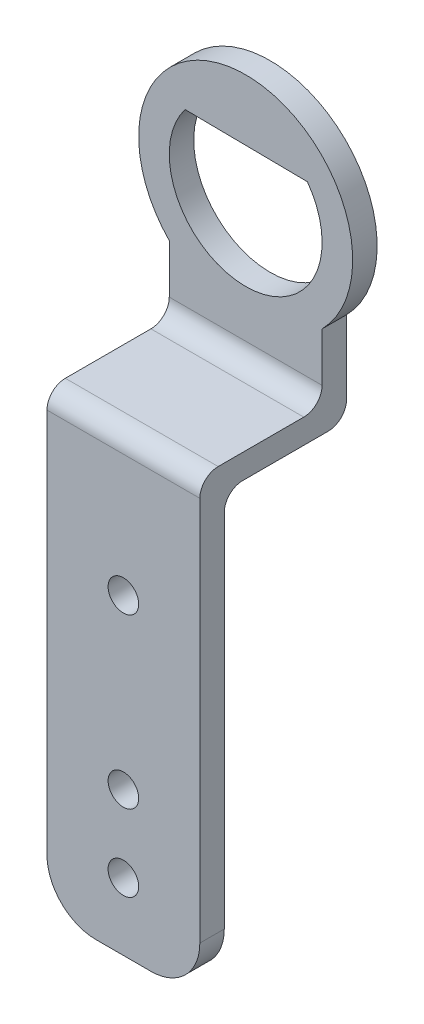
ISO-10303-21;
HEADER;
FILE_DESCRIPTION(('STEP AP214'),'2;1');
FILE_NAME('part.step','',(''),(''),'','','');
FILE_SCHEMA(('AUTOMOTIVE_DESIGN { 1 0 10303 214 1 1 1 1 }'));
ENDSEC;
DATA;
#1=APPLICATION_CONTEXT('core data for automotive mechanical design processes');
#2=APPLICATION_PROTOCOL_DEFINITION('international standard','automotive_design',2000,#1);
#3=PRODUCT_CONTEXT('',#1,'mechanical');
#4=PRODUCT('Part','Part','',(#3));
#5=PRODUCT_RELATED_PRODUCT_CATEGORY('part','',(#4));
#6=PRODUCT_DEFINITION_FORMATION('','',#4);
#7=PRODUCT_DEFINITION_CONTEXT('part definition',#1,'design');
#8=PRODUCT_DEFINITION('design','',#6,#7);
#9=PRODUCT_DEFINITION_SHAPE('','',#8);
#10=(LENGTH_UNIT() NAMED_UNIT(*) SI_UNIT(.MILLI.,.METRE.));
#11=(NAMED_UNIT(*) PLANE_ANGLE_UNIT() SI_UNIT($,.RADIAN.));
#12=(NAMED_UNIT(*) SI_UNIT($,.STERADIAN.) SOLID_ANGLE_UNIT());
#13=UNCERTAINTY_MEASURE_WITH_UNIT(LENGTH_MEASURE(1.E-05),#10,'distance_accuracy_value','');
#14=(GEOMETRIC_REPRESENTATION_CONTEXT(3) GLOBAL_UNCERTAINTY_ASSIGNED_CONTEXT((#13)) GLOBAL_UNIT_ASSIGNED_CONTEXT((#10,
#11,#12)) REPRESENTATION_CONTEXT('',''));
#15=CARTESIAN_POINT('',(0.,0.,0.));
#16=DIRECTION('',(0.,0.,1.));
#17=DIRECTION('',(1.,0.,0.));
#18=AXIS2_PLACEMENT_3D('',#15,#16,#17);
#19=CARTESIAN_POINT('',(0.266025337211541,-3.51925285208698,0.4));
#20=DIRECTION('',(0.,1.,0.));
#21=DIRECTION('',(0.,0.,1.));
#22=AXIS2_PLACEMENT_3D('',#19,#20,#21);
#23=PLANE('',#22);
#24=DIRECTION('',(0.,0.,-1.));
#25=VECTOR('',#24,1.);
#26=CARTESIAN_POINT('',(0.266025337211541,-3.51925285208698,0.4));
#27=LINE('',#26,#25);
#28=CARTESIAN_POINT('',(0.266025337211541,-3.51925285208698,1.7));
#29=VERTEX_POINT('',#28);
#30=CARTESIAN_POINT('',(0.266025337211541,-3.51925285208698,0.3));
#31=VERTEX_POINT('',#30);
#32=EDGE_CURVE('E221',#29,#31,#27,.T.);
#33=ORIENTED_EDGE('',*,*,#32,.T.);
#34=DIRECTION('',(1.,0.,0.));
#35=VECTOR('',#34,1.);
#36=CARTESIAN_POINT('',(0.266025337211541,-3.51925285208698,0.3));
#37=LINE('',#36,#35);
#38=CARTESIAN_POINT('',(2.76602533721154,-3.51925285208698,0.3));
#39=VERTEX_POINT('',#38);
#40=EDGE_CURVE('E242',#31,#39,#37,.T.);
#41=ORIENTED_EDGE('',*,*,#40,.T.);
#42=DIRECTION('',(0.,0.,-1.));
#43=VECTOR('',#42,1.);
#44=CARTESIAN_POINT('',(2.76602533721154,-3.51925285208698,0.4));
#45=LINE('',#44,#43);
#46=CARTESIAN_POINT('',(2.76602533721154,-3.51925285208698,1.7));
#47=VERTEX_POINT('',#46);
#48=EDGE_CURVE('E217',#47,#39,#45,.T.);
#49=ORIENTED_EDGE('',*,*,#48,.F.);
#50=DIRECTION('',(1.,0.,0.));
#51=VECTOR('',#50,1.);
#52=CARTESIAN_POINT('',(0.26602533721154,-3.51925285208698,1.7));
#53=LINE('',#52,#51);
#54=EDGE_CURVE('E239',#47,#29,#53,.F.);
#55=ORIENTED_EDGE('',*,*,#54,.T.);
#56=EDGE_LOOP('',(#33,#41,#49,#55));
#57=FACE_BOUND('',#56,.T.);
#58=ADVANCED_FACE('F41',(#57),#23,.F.);
#59=CARTESIAN_POINT('',(1.51602533721154,-0.794507980695394,0.4));
#60=DIRECTION('',(0.,0.,1.));
#61=DIRECTION('',(1.,0.,0.));
#62=AXIS2_PLACEMENT_3D('',#59,#60,#61);
#63=PLANE('',#62);
#64=DIRECTION('',(0.,-1.,0.));
#65=VECTOR('',#64,1.);
#66=CARTESIAN_POINT('',(0.26602533721154,-2.01925285208698,0.4));
#67=LINE('',#66,#65);
#68=CARTESIAN_POINT('',(0.26602533721154,-2.01925285208698,0.4));
#69=VERTEX_POINT('',#68);
#70=CARTESIAN_POINT('',(0.266025337211541,-2.81925285208698,0.4));
#71=VERTEX_POINT('',#70);
#72=EDGE_CURVE('E196',#69,#71,#67,.T.);
#73=ORIENTED_EDGE('',*,*,#72,.T.);
#74=DIRECTION('',(-1.,0.,0.));
#75=VECTOR('',#74,1.);
#76=CARTESIAN_POINT('',(1.51602533721154,-2.81925285208698,0.4));
#77=LINE('',#76,#75);
#78=CARTESIAN_POINT('',(2.76602533721154,-2.81925285208698,0.4));
#79=VERTEX_POINT('',#78);
#80=EDGE_CURVE('E236',#71,#79,#77,.F.);
#81=ORIENTED_EDGE('',*,*,#80,.T.);
#82=DIRECTION('',(0.,1.,0.));
#83=VECTOR('',#82,1.);
#84=CARTESIAN_POINT('',(2.76602533721154,-2.01925285208698,0.4));
#85=LINE('',#84,#83);
#86=CARTESIAN_POINT('',(2.76602533721154,-2.01925285208698,0.4));
#87=VERTEX_POINT('',#86);
#88=EDGE_CURVE('E201',#79,#87,#85,.T.);
#89=ORIENTED_EDGE('',*,*,#88,.T.);
#90=CARTESIAN_POINT('',(1.51602533721154,-0.794507980695394,0.4));
#91=DIRECTION('',(0.,0.,1.));
#92=DIRECTION('',(1.,0.,0.));
#93=AXIS2_PLACEMENT_3D('',#90,#91,#92);
#94=CIRCLE('',#93,1.75);
#95=EDGE_CURVE('E192',#87,#69,#94,.T.);
#96=ORIENTED_EDGE('',*,*,#95,.T.);
#97=EDGE_LOOP('',(#73,#81,#89,#96));
#98=FACE_BOUND('',#97,.T.);
#99=DIRECTION('',(-0.999932424571889,0.0116252436440397,0.));
#100=VECTOR('',#99,1.);
#101=CARTESIAN_POINT('',(2.52467669451646,-0.0561839059105169,0.4));
#102=LINE('',#101,#100);
#103=CARTESIAN_POINT('',(2.52467669451646,-0.0561839059105168,0.4));
#104=VERTEX_POINT('',#103);
#105=CARTESIAN_POINT('',(0.524811845372683,-0.0329334186224376,0.4));
#106=VERTEX_POINT('',#105);
#107=EDGE_CURVE('E158',#104,#106,#102,.T.);
#108=ORIENTED_EDGE('',*,*,#107,.F.);
#109=CARTESIAN_POINT('',(1.51602533721154,-0.794507980695394,0.4));
#110=DIRECTION('',(0.,0.,1.));
#111=DIRECTION('',(1.,0.,0.));
#112=AXIS2_PLACEMENT_3D('',#109,#110,#111);
#113=CIRCLE('',#112,1.25);
#114=EDGE_CURVE('E169',#106,#104,#113,.T.);
#115=ORIENTED_EDGE('',*,*,#114,.F.);
#116=EDGE_LOOP('',(#108,#115));
#117=FACE_BOUND('',#116,.T.);
#118=ADVANCED_FACE('F177',(#98,#117),#63,.T.);
#119=CARTESIAN_POINT('',(1.51602533721154,-0.794507980695394,0.));
#120=DIRECTION('',(0.,0.,1.));
#121=DIRECTION('',(1.,0.,0.));
#122=AXIS2_PLACEMENT_3D('',#119,#120,#121);
#123=PLANE('',#122);
#124=DIRECTION('',(0.,1.,0.));
#125=VECTOR('',#124,1.);
#126=CARTESIAN_POINT('',(2.76602533721154,-2.01925285208698,0.));
#127=LINE('',#126,#125);
#128=CARTESIAN_POINT('',(2.76602533721154,-3.21925285208698,0.));
#129=VERTEX_POINT('',#128);
#130=CARTESIAN_POINT('',(2.76602533721154,-2.01925285208698,0.));
#131=VERTEX_POINT('',#130);
#132=EDGE_CURVE('E197',#129,#131,#127,.T.);
#133=ORIENTED_EDGE('',*,*,#132,.F.);
#134=DIRECTION('',(1.,0.,0.));
#135=VECTOR('',#134,1.);
#136=CARTESIAN_POINT('',(1.51602533721154,-3.21925285208698,0.));
#137=LINE('',#136,#135);
#138=CARTESIAN_POINT('',(0.266025337211541,-3.21925285208698,0.));
#139=VERTEX_POINT('',#138);
#140=EDGE_CURVE('E253',#129,#139,#137,.F.);
#141=ORIENTED_EDGE('',*,*,#140,.T.);
#142=DIRECTION('',(0.,-1.,0.));
#143=VECTOR('',#142,1.);
#144=CARTESIAN_POINT('',(0.26602533721154,-2.01925285208698,0.));
#145=LINE('',#144,#143);
#146=CARTESIAN_POINT('',(0.26602533721154,-2.01925285208698,0.));
#147=VERTEX_POINT('',#146);
#148=EDGE_CURVE('E208',#147,#139,#145,.T.);
#149=ORIENTED_EDGE('',*,*,#148,.F.);
#150=CARTESIAN_POINT('',(1.51602533721154,-0.794507980695394,0.));
#151=DIRECTION('',(0.,0.,1.));
#152=DIRECTION('',(1.,0.,0.));
#153=AXIS2_PLACEMENT_3D('',#150,#151,#152);
#154=CIRCLE('',#153,1.75);
#155=EDGE_CURVE('E191',#131,#147,#154,.T.);
#156=ORIENTED_EDGE('',*,*,#155,.F.);
#157=EDGE_LOOP('',(#133,#141,#149,#156));
#158=FACE_BOUND('',#157,.T.);
#159=CARTESIAN_POINT('',(1.51602533721154,-0.794507980695394,0.));
#160=DIRECTION('',(0.,0.,1.));
#161=DIRECTION('',(1.,0.,0.));
#162=AXIS2_PLACEMENT_3D('',#159,#160,#161);
#163=CIRCLE('',#162,1.25);
#164=CARTESIAN_POINT('',(0.524811845372683,-0.0329334186224375,0.));
#165=VERTEX_POINT('',#164);
#166=CARTESIAN_POINT('',(2.52467669451646,-0.0561839059105169,0.));
#167=VERTEX_POINT('',#166);
#168=EDGE_CURVE('E174',#165,#167,#163,.T.);
#169=ORIENTED_EDGE('',*,*,#168,.T.);
#170=DIRECTION('',(-0.999932424571889,0.0116252436440397,0.));
#171=VECTOR('',#170,1.);
#172=CARTESIAN_POINT('',(2.52467669451646,-0.0561839059105169,0.));
#173=LINE('',#172,#171);
#174=EDGE_CURVE('E179',#167,#165,#173,.T.);
#175=ORIENTED_EDGE('',*,*,#174,.T.);
#176=EDGE_LOOP('',(#169,#175));
#177=FACE_BOUND('',#176,.T.);
#178=ADVANCED_FACE('F414',(#158,#177),#123,.F.);
#179=CARTESIAN_POINT('',(1.51602533721154,-0.794507980695394,0.4));
#180=DIRECTION('',(0.,0.,-1.));
#181=DIRECTION('',(-1.,0.,0.));
#182=AXIS2_PLACEMENT_3D('',#179,#180,#181);
#183=CYLINDRICAL_SURFACE('',#182,1.75);
#184=ORIENTED_EDGE('',*,*,#155,.T.);
#185=DIRECTION('',(0.,0.,-1.));
#186=VECTOR('',#185,1.);
#187=CARTESIAN_POINT('',(0.26602533721154,-2.01925285208698,0.4));
#188=LINE('',#187,#186);
#189=EDGE_CURVE('E225',#69,#147,#188,.T.);
#190=ORIENTED_EDGE('',*,*,#189,.F.);
#191=ORIENTED_EDGE('',*,*,#95,.F.);
#192=DIRECTION('',(0.,0.,-1.));
#193=VECTOR('',#192,1.);
#194=CARTESIAN_POINT('',(2.76602533721154,-2.01925285208698,0.4));
#195=LINE('',#194,#193);
#196=EDGE_CURVE('E204',#87,#131,#195,.T.);
#197=ORIENTED_EDGE('',*,*,#196,.T.);
#198=EDGE_LOOP('',(#184,#190,#191,#197));
#199=FACE_BOUND('',#198,.T.);
#200=ADVANCED_FACE('F365',(#199),#183,.T.);
#201=CARTESIAN_POINT('',(0.26602533721154,-2.01925285208698,0.4));
#202=DIRECTION('',(1.,0.,0.));
#203=DIRECTION('',(0.,1.,0.));
#204=AXIS2_PLACEMENT_3D('',#201,#202,#203);
#205=PLANE('',#204);
#206=DIRECTION('',(0.,1.,0.));
#207=VECTOR('',#206,1.);
#208=CARTESIAN_POINT('',(0.266025337211541,-10.519252852087,2.));
#209=LINE('',#208,#207);
#210=CARTESIAN_POINT('',(0.266025337211541,-9.71925285208698,2.));
#211=VERTEX_POINT('',#210);
#212=CARTESIAN_POINT('',(0.266025337211541,-3.81925285208698,2.));
#213=VERTEX_POINT('',#212);
#214=EDGE_CURVE('E333',#211,#213,#209,.T.);
#215=ORIENTED_EDGE('',*,*,#214,.F.);
#216=DIRECTION('',(0.,0.,-1.));
#217=VECTOR('',#216,1.);
#218=CARTESIAN_POINT('',(0.266025337211541,-9.71925285208698,0.4));
#219=LINE('',#218,#217);
#220=CARTESIAN_POINT('',(0.266025337211541,-9.71925285208698,2.4));
#221=VERTEX_POINT('',#220);
#222=EDGE_CURVE('E67',#211,#221,#219,.F.);
#223=ORIENTED_EDGE('',*,*,#222,.T.);
#224=DIRECTION('',(0.,-1.,0.));
#225=VECTOR('',#224,1.);
#226=CARTESIAN_POINT('',(0.266025337211541,-3.11925285208698,2.4));
#227=LINE('',#226,#225);
#228=CARTESIAN_POINT('',(0.266025337211541,-3.41925285208698,2.4));
#229=VERTEX_POINT('',#228);
#230=EDGE_CURVE('E339',#229,#221,#227,.T.);
#231=ORIENTED_EDGE('',*,*,#230,.F.);
#232=CARTESIAN_POINT('',(0.266025337211541,-3.41925285208698,2.1));
#233=DIRECTION('',(1.,0.,0.));
#234=DIRECTION('',(0.,1.,0.));
#235=AXIS2_PLACEMENT_3D('',#232,#233,#234);
#236=CIRCLE('',#235,0.3);
#237=CARTESIAN_POINT('',(0.266025337211541,-3.11925285208698,2.1));
#238=VERTEX_POINT('',#237);
#239=EDGE_CURVE('E256',#229,#238,#236,.F.);
#240=ORIENTED_EDGE('',*,*,#239,.T.);
#241=DIRECTION('',(0.,0.,-1.));
#242=VECTOR('',#241,1.);
#243=CARTESIAN_POINT('',(0.266025337211541,-3.11925285208698,2.4));
#244=LINE('',#243,#242);
#245=CARTESIAN_POINT('',(0.266025337211541,-3.11925285208698,0.7));
#246=VERTEX_POINT('',#245);
#247=EDGE_CURVE('E341',#238,#246,#244,.T.);
#248=ORIENTED_EDGE('',*,*,#247,.T.);
#249=CARTESIAN_POINT('',(0.266025337211541,-2.81925285208698,0.7));
#250=DIRECTION('',(1.,0.,0.));
#251=DIRECTION('',(0.,1.,0.));
#252=AXIS2_PLACEMENT_3D('',#249,#250,#251);
#253=CIRCLE('',#252,0.3);
#254=EDGE_CURVE('E270',#246,#71,#253,.T.);
#255=ORIENTED_EDGE('',*,*,#254,.T.);
#256=ORIENTED_EDGE('',*,*,#72,.F.);
#257=ORIENTED_EDGE('',*,*,#189,.T.);
#258=ORIENTED_EDGE('',*,*,#148,.T.);
#259=CARTESIAN_POINT('',(0.266025337211541,-3.21925285208698,0.3));
#260=DIRECTION('',(1.,0.,0.));
#261=DIRECTION('',(0.,1.,0.));
#262=AXIS2_PLACEMENT_3D('',#259,#260,#261);
#263=CIRCLE('',#262,0.3);
#264=EDGE_CURVE('E259',#139,#31,#263,.F.);
#265=ORIENTED_EDGE('',*,*,#264,.T.);
#266=ORIENTED_EDGE('',*,*,#32,.F.);
#267=CARTESIAN_POINT('',(0.26602533721154,-3.81925285208698,1.7));
#268=DIRECTION('',(1.,0.,0.));
#269=DIRECTION('',(0.,1.,0.));
#270=AXIS2_PLACEMENT_3D('',#267,#268,#269);
#271=CIRCLE('',#270,0.3);
#272=EDGE_CURVE('E279',#29,#213,#271,.T.);
#273=ORIENTED_EDGE('',*,*,#272,.T.);
#274=EDGE_LOOP('',(#215,#223,#231,#240,#248,#255,#256,#257,#258,#265,#266,#273));
#275=FACE_BOUND('',#274,.T.);
#276=ADVANCED_FACE('F358',(#275),#205,.F.);
#277=CARTESIAN_POINT('',(2.76602533721154,-2.01925285208698,0.4));
#278=DIRECTION('',(-1.,0.,0.));
#279=DIRECTION('',(0.,0.,1.));
#280=AXIS2_PLACEMENT_3D('',#277,#278,#279);
#281=PLANE('',#280);
#282=DIRECTION('',(0.,1.,0.));
#283=VECTOR('',#282,1.);
#284=CARTESIAN_POINT('',(2.76602533721154,-3.51925285208698,2.4));
#285=LINE('',#284,#283);
#286=CARTESIAN_POINT('',(2.76602533721154,-9.71925285208698,2.4));
#287=VERTEX_POINT('',#286);
#288=CARTESIAN_POINT('',(2.76602533721154,-3.41925285208698,2.4));
#289=VERTEX_POINT('',#288);
#290=EDGE_CURVE('E336',#287,#289,#285,.T.);
#291=ORIENTED_EDGE('',*,*,#290,.F.);
#292=DIRECTION('',(0.,0.,1.));
#293=VECTOR('',#292,1.);
#294=CARTESIAN_POINT('',(2.76602533721154,-9.71925285208698,0.4));
#295=LINE('',#294,#293);
#296=CARTESIAN_POINT('',(2.76602533721154,-9.71925285208698,2.));
#297=VERTEX_POINT('',#296);
#298=EDGE_CURVE('E11',#287,#297,#295,.F.);
#299=ORIENTED_EDGE('',*,*,#298,.T.);
#300=DIRECTION('',(0.,1.,0.));
#301=VECTOR('',#300,1.);
#302=CARTESIAN_POINT('',(2.76602533721154,-10.519252852087,2.));
#303=LINE('',#302,#301);
#304=CARTESIAN_POINT('',(2.76602533721154,-3.81925285208698,2.));
#305=VERTEX_POINT('',#304);
#306=EDGE_CURVE('E325',#297,#305,#303,.T.);
#307=ORIENTED_EDGE('',*,*,#306,.T.);
#308=CARTESIAN_POINT('',(2.76602533721154,-3.81925285208698,1.7));
#309=DIRECTION('',(-1.,0.,0.));
#310=DIRECTION('',(0.,0.,1.));
#311=AXIS2_PLACEMENT_3D('',#308,#309,#310);
#312=CIRCLE('',#311,0.3);
#313=EDGE_CURVE('E276',#305,#47,#312,.T.);
#314=ORIENTED_EDGE('',*,*,#313,.T.);
#315=ORIENTED_EDGE('',*,*,#48,.T.);
#316=CARTESIAN_POINT('',(2.76602533721154,-3.21925285208698,0.3));
#317=DIRECTION('',(-1.,0.,0.));
#318=DIRECTION('',(0.,0.,1.));
#319=AXIS2_PLACEMENT_3D('',#316,#317,#318);
#320=CIRCLE('',#319,0.3);
#321=EDGE_CURVE('E250',#39,#129,#320,.F.);
#322=ORIENTED_EDGE('',*,*,#321,.T.);
#323=ORIENTED_EDGE('',*,*,#132,.T.);
#324=ORIENTED_EDGE('',*,*,#196,.F.);
#325=ORIENTED_EDGE('',*,*,#88,.F.);
#326=CARTESIAN_POINT('',(2.76602533721154,-2.81925285208698,0.7));
#327=DIRECTION('',(-1.,0.,0.));
#328=DIRECTION('',(0.,0.,1.));
#329=AXIS2_PLACEMENT_3D('',#326,#327,#328);
#330=CIRCLE('',#329,0.3);
#331=CARTESIAN_POINT('',(2.76602533721154,-3.11925285208698,0.7));
#332=VERTEX_POINT('',#331);
#333=EDGE_CURVE('E273',#79,#332,#330,.T.);
#334=ORIENTED_EDGE('',*,*,#333,.T.);
#335=DIRECTION('',(0.,0.,-1.));
#336=VECTOR('',#335,1.);
#337=CARTESIAN_POINT('',(2.76602533721154,-3.11925285208698,2.4));
#338=LINE('',#337,#336);
#339=CARTESIAN_POINT('',(2.76602533721154,-3.11925285208698,2.1));
#340=VERTEX_POINT('',#339);
#341=EDGE_CURVE('E184',#340,#332,#338,.T.);
#342=ORIENTED_EDGE('',*,*,#341,.F.);
#343=CARTESIAN_POINT('',(2.76602533721154,-3.41925285208698,2.1));
#344=DIRECTION('',(-1.,0.,0.));
#345=DIRECTION('',(0.,0.,1.));
#346=AXIS2_PLACEMENT_3D('',#343,#344,#345);
#347=CIRCLE('',#346,0.3);
#348=EDGE_CURVE('E246',#340,#289,#347,.F.);
#349=ORIENTED_EDGE('',*,*,#348,.T.);
#350=EDGE_LOOP('',(#291,#299,#307,#314,#315,#322,#323,#324,#325,#334,#342,#349));
#351=FACE_BOUND('',#350,.T.);
#352=ADVANCED_FACE('F377',(#351),#281,.F.);
#353=CARTESIAN_POINT('',(1.51602533721154,-0.794507980695394,0.4));
#354=DIRECTION('',(0.,0.,-1.));
#355=DIRECTION('',(-1.,0.,0.));
#356=AXIS2_PLACEMENT_3D('',#353,#354,#355);
#357=CYLINDRICAL_SURFACE('',#356,1.25);
#358=ORIENTED_EDGE('',*,*,#168,.F.);
#359=DIRECTION('',(0.,0.,-1.));
#360=VECTOR('',#359,1.);
#361=CARTESIAN_POINT('',(0.524811845372683,-0.0329334186224376,0.4));
#362=LINE('',#361,#360);
#363=EDGE_CURVE('E161',#106,#165,#362,.T.);
#364=ORIENTED_EDGE('',*,*,#363,.F.);
#365=ORIENTED_EDGE('',*,*,#114,.T.);
#366=DIRECTION('',(0.,0.,-1.));
#367=VECTOR('',#366,1.);
#368=CARTESIAN_POINT('',(2.52467669451646,-0.0561839059105169,0.4));
#369=LINE('',#368,#367);
#370=EDGE_CURVE('E164',#104,#167,#369,.T.);
#371=ORIENTED_EDGE('',*,*,#370,.T.);
#372=EDGE_LOOP('',(#358,#364,#365,#371));
#373=FACE_BOUND('',#372,.T.);
#374=ADVANCED_FACE('F172',(#373),#357,.F.);
#375=CARTESIAN_POINT('',(2.52467669451646,-0.0561839059105169,0.4));
#376=DIRECTION('',(-0.0116252436440397,-0.999932424571889,0.));
#377=DIRECTION('',(0.999932424571889,-0.0116252436440397,0.));
#378=AXIS2_PLACEMENT_3D('',#375,#376,#377);
#379=PLANE('',#378);
#380=ORIENTED_EDGE('',*,*,#174,.F.);
#381=ORIENTED_EDGE('',*,*,#370,.F.);
#382=ORIENTED_EDGE('',*,*,#107,.T.);
#383=ORIENTED_EDGE('',*,*,#363,.T.);
#384=EDGE_LOOP('',(#380,#381,#382,#383));
#385=FACE_BOUND('',#384,.T.);
#386=ADVANCED_FACE('F160',(#385),#379,.T.);
#387=CARTESIAN_POINT('',(0.266025337211541,-3.11925285208698,2.4));
#388=DIRECTION('',(0.,-1.,0.));
#389=DIRECTION('',(0.,0.,-1.));
#390=AXIS2_PLACEMENT_3D('',#387,#388,#389);
#391=PLANE('',#390);
#392=ORIENTED_EDGE('',*,*,#341,.T.);
#393=DIRECTION('',(-1.,0.,0.));
#394=VECTOR('',#393,1.);
#395=CARTESIAN_POINT('',(0.266025337211541,-3.11925285208698,0.7));
#396=LINE('',#395,#394);
#397=EDGE_CURVE('E232',#332,#246,#396,.T.);
#398=ORIENTED_EDGE('',*,*,#397,.T.);
#399=ORIENTED_EDGE('',*,*,#247,.F.);
#400=DIRECTION('',(-1.,0.,0.));
#401=VECTOR('',#400,1.);
#402=CARTESIAN_POINT('',(2.76602533721154,-3.11925285208698,2.1));
#403=LINE('',#402,#401);
#404=EDGE_CURVE('E229',#238,#340,#403,.F.);
#405=ORIENTED_EDGE('',*,*,#404,.T.);
#406=EDGE_LOOP('',(#392,#398,#399,#405));
#407=FACE_BOUND('',#406,.T.);
#408=ADVANCED_FACE('F350',(#407),#391,.F.);
#409=CARTESIAN_POINT('',(0.,0.,2.4));
#410=DIRECTION('',(0.,0.,1.));
#411=DIRECTION('',(1.,0.,0.));
#412=AXIS2_PLACEMENT_3D('',#409,#410,#411);
#413=PLANE('',#412);
#414=CARTESIAN_POINT('',(1.51602533721154,-5.41925285208698,2.4));
#415=DIRECTION('',(0.,0.,1.));
#416=DIRECTION('',(1.,0.,0.));
#417=AXIS2_PLACEMENT_3D('',#414,#415,#416);
#418=CIRCLE('',#417,0.25);
#419=CARTESIAN_POINT('',(1.76602533721154,-5.41925285208698,2.4));
#420=VERTEX_POINT('',#419);
#421=EDGE_CURVE('E307',#420,#420,#418,.T.);
#422=ORIENTED_EDGE('',*,*,#421,.F.);
#423=EDGE_LOOP('',(#422));
#424=FACE_BOUND('',#423,.T.);
#425=CARTESIAN_POINT('',(1.51602533721154,-9.41925285208698,2.4));
#426=DIRECTION('',(0.,0.,1.));
#427=DIRECTION('',(-1.,0.,0.));
#428=AXIS2_PLACEMENT_3D('',#425,#426,#427);
#429=CIRCLE('',#428,0.25);
#430=CARTESIAN_POINT('',(1.26602533721154,-9.41925285208698,2.4));
#431=VERTEX_POINT('',#430);
#432=EDGE_CURVE('E456',#431,#431,#429,.T.);
#433=ORIENTED_EDGE('',*,*,#432,.F.);
#434=EDGE_LOOP('',(#433));
#435=FACE_BOUND('',#434,.T.);
#436=CARTESIAN_POINT('',(1.51602533721154,-8.16925285208698,2.4));
#437=DIRECTION('',(0.,0.,1.));
#438=DIRECTION('',(1.,0.,0.));
#439=AXIS2_PLACEMENT_3D('',#436,#437,#438);
#440=CIRCLE('',#439,0.25);
#441=CARTESIAN_POINT('',(1.76602533721154,-8.16925285208698,2.4));
#442=VERTEX_POINT('',#441);
#443=EDGE_CURVE('E328',#442,#442,#440,.T.);
#444=ORIENTED_EDGE('',*,*,#443,.F.);
#445=EDGE_LOOP('',(#444));
#446=FACE_BOUND('',#445,.T.);
#447=ORIENTED_EDGE('',*,*,#230,.T.);
#448=CARTESIAN_POINT('',(1.06602533721154,-9.71925285208698,2.4));
#449=DIRECTION('',(0.,0.,1.));
#450=DIRECTION('',(1.,0.,0.));
#451=AXIS2_PLACEMENT_3D('',#448,#449,#450);
#452=CIRCLE('',#451,0.8);
#453=CARTESIAN_POINT('',(1.06602533721154,-10.519252852087,2.4));
#454=VERTEX_POINT('',#453);
#455=EDGE_CURVE('E51',#221,#454,#452,.T.);
#456=ORIENTED_EDGE('',*,*,#455,.T.);
#457=DIRECTION('',(-1.,0.,0.));
#458=VECTOR('',#457,1.);
#459=CARTESIAN_POINT('',(0.266025337211541,-10.519252852087,2.4));
#460=LINE('',#459,#458);
#461=CARTESIAN_POINT('',(1.96602533721154,-10.519252852087,2.4));
#462=VERTEX_POINT('',#461);
#463=EDGE_CURVE('E314',#462,#454,#460,.T.);
#464=ORIENTED_EDGE('',*,*,#463,.F.);
#465=CARTESIAN_POINT('',(1.96602533721154,-9.71925285208698,2.4));
#466=DIRECTION('',(0.,0.,1.));
#467=DIRECTION('',(1.,0.,0.));
#468=AXIS2_PLACEMENT_3D('',#465,#466,#467);
#469=CIRCLE('',#468,0.8);
#470=EDGE_CURVE('E59',#462,#287,#469,.T.);
#471=ORIENTED_EDGE('',*,*,#470,.T.);
#472=ORIENTED_EDGE('',*,*,#290,.T.);
#473=DIRECTION('',(-1.,0.,0.));
#474=VECTOR('',#473,1.);
#475=CARTESIAN_POINT('',(0.266025337211541,-3.41925285208698,2.4));
#476=LINE('',#475,#474);
#477=EDGE_CURVE('E266',#289,#229,#476,.T.);
#478=ORIENTED_EDGE('',*,*,#477,.T.);
#479=EDGE_LOOP('',(#447,#456,#464,#471,#472,#478));
#480=FACE_BOUND('',#479,.T.);
#481=ADVANCED_FACE('F392',(#424,#435,#446,#480),#413,.T.);
#482=CARTESIAN_POINT('',(2.76602533721154,-10.519252852087,2.));
#483=DIRECTION('',(0.,0.,1.));
#484=DIRECTION('',(1.,0.,0.));
#485=AXIS2_PLACEMENT_3D('',#482,#483,#484);
#486=PLANE('',#485);
#487=CARTESIAN_POINT('',(1.51602533721154,-5.41925285208698,2.));
#488=DIRECTION('',(0.,0.,1.));
#489=DIRECTION('',(1.,0.,0.));
#490=AXIS2_PLACEMENT_3D('',#487,#488,#489);
#491=CIRCLE('',#490,0.25);
#492=CARTESIAN_POINT('',(1.76602533721154,-5.41925285208698,2.));
#493=VERTEX_POINT('',#492);
#494=EDGE_CURVE('E45',#493,#493,#491,.T.);
#495=ORIENTED_EDGE('',*,*,#494,.T.);
#496=EDGE_LOOP('',(#495));
#497=FACE_BOUND('',#496,.T.);
#498=CARTESIAN_POINT('',(1.51602533721154,-9.41925285208698,2.));
#499=DIRECTION('',(0.,0.,1.));
#500=DIRECTION('',(1.,0.,0.));
#501=AXIS2_PLACEMENT_3D('',#498,#499,#500);
#502=CIRCLE('',#501,0.25);
#503=CARTESIAN_POINT('',(1.76602533721154,-9.41925285208698,2.));
#504=VERTEX_POINT('',#503);
#505=EDGE_CURVE('E306',#504,#504,#502,.T.);
#506=ORIENTED_EDGE('',*,*,#505,.T.);
#507=EDGE_LOOP('',(#506));
#508=FACE_BOUND('',#507,.T.);
#509=CARTESIAN_POINT('',(1.51602533721154,-8.16925285208698,2.));
#510=DIRECTION('',(0.,0.,1.));
#511=DIRECTION('',(1.,0.,0.));
#512=AXIS2_PLACEMENT_3D('',#509,#510,#511);
#513=CIRCLE('',#512,0.25);
#514=CARTESIAN_POINT('',(1.76602533721154,-8.16925285208698,2.));
#515=VERTEX_POINT('',#514);
#516=EDGE_CURVE('E303',#515,#515,#513,.T.);
#517=ORIENTED_EDGE('',*,*,#516,.T.);
#518=EDGE_LOOP('',(#517));
#519=FACE_BOUND('',#518,.T.);
#520=DIRECTION('',(1.,0.,0.));
#521=VECTOR('',#520,1.);
#522=CARTESIAN_POINT('',(2.76602533721154,-10.519252852087,2.));
#523=LINE('',#522,#521);
#524=CARTESIAN_POINT('',(1.06602533721154,-10.519252852087,2.));
#525=VERTEX_POINT('',#524);
#526=CARTESIAN_POINT('',(1.96602533721154,-10.519252852087,2.));
#527=VERTEX_POINT('',#526);
#528=EDGE_CURVE('E319',#525,#527,#523,.T.);
#529=ORIENTED_EDGE('',*,*,#528,.F.);
#530=CARTESIAN_POINT('',(1.06602533721154,-9.71925285208698,2.));
#531=DIRECTION('',(0.,0.,1.));
#532=DIRECTION('',(1.,0.,0.));
#533=AXIS2_PLACEMENT_3D('',#530,#531,#532);
#534=CIRCLE('',#533,0.8);
#535=EDGE_CURVE('E294',#525,#211,#534,.F.);
#536=ORIENTED_EDGE('',*,*,#535,.T.);
#537=ORIENTED_EDGE('',*,*,#214,.T.);
#538=DIRECTION('',(1.,0.,0.));
#539=VECTOR('',#538,1.);
#540=CARTESIAN_POINT('',(2.76602533721154,-3.81925285208698,2.));
#541=LINE('',#540,#539);
#542=EDGE_CURVE('E262',#213,#305,#541,.T.);
#543=ORIENTED_EDGE('',*,*,#542,.T.);
#544=ORIENTED_EDGE('',*,*,#306,.F.);
#545=CARTESIAN_POINT('',(1.96602533721154,-9.71925285208698,2.));
#546=DIRECTION('',(0.,0.,1.));
#547=DIRECTION('',(1.,0.,0.));
#548=AXIS2_PLACEMENT_3D('',#545,#546,#547);
#549=CIRCLE('',#548,0.8);
#550=EDGE_CURVE('E291',#297,#527,#549,.F.);
#551=ORIENTED_EDGE('',*,*,#550,.T.);
#552=EDGE_LOOP('',(#529,#536,#537,#543,#544,#551));
#553=FACE_BOUND('',#552,.T.);
#554=ADVANCED_FACE('F387',(#497,#508,#519,#553),#486,.F.);
#555=CARTESIAN_POINT('',(0.,-10.519252852087,0.));
#556=DIRECTION('',(0.,1.,0.));
#557=DIRECTION('',(0.,0.,1.));
#558=AXIS2_PLACEMENT_3D('',#555,#556,#557);
#559=PLANE('',#558);
#560=ORIENTED_EDGE('',*,*,#463,.T.);
#561=DIRECTION('',(0.,0.,-1.));
#562=VECTOR('',#561,1.);
#563=CARTESIAN_POINT('',(1.06602533721154,-10.519252852087,0.));
#564=LINE('',#563,#562);
#565=EDGE_CURVE('E287',#454,#525,#564,.T.);
#566=ORIENTED_EDGE('',*,*,#565,.T.);
#567=ORIENTED_EDGE('',*,*,#528,.T.);
#568=DIRECTION('',(0.,0.,1.));
#569=VECTOR('',#568,1.);
#570=CARTESIAN_POINT('',(1.96602533721154,-10.519252852087,0.));
#571=LINE('',#570,#569);
#572=EDGE_CURVE('E283',#527,#462,#571,.T.);
#573=ORIENTED_EDGE('',*,*,#572,.T.);
#574=EDGE_LOOP('',(#560,#566,#567,#573));
#575=FACE_BOUND('',#574,.T.);
#576=ADVANCED_FACE('F399',(#575),#559,.F.);
#577=CARTESIAN_POINT('',(0.266025337211541,-2.81925285208698,0.7));
#578=DIRECTION('',(-1.,0.,0.));
#579=DIRECTION('',(0.,0.,1.));
#580=AXIS2_PLACEMENT_3D('',#577,#578,#579);
#581=CYLINDRICAL_SURFACE('',#580,0.3);
#582=ORIENTED_EDGE('',*,*,#333,.F.);
#583=ORIENTED_EDGE('',*,*,#80,.F.);
#584=ORIENTED_EDGE('',*,*,#254,.F.);
#585=ORIENTED_EDGE('',*,*,#397,.F.);
#586=EDGE_LOOP('',(#582,#583,#584,#585));
#587=FACE_BOUND('',#586,.T.);
#588=ADVANCED_FACE('F356',(#587),#581,.F.);
#589=CARTESIAN_POINT('',(0.266025337211541,-3.21925285208698,0.3));
#590=DIRECTION('',(1.,0.,0.));
#591=DIRECTION('',(0.,0.,-1.));
#592=AXIS2_PLACEMENT_3D('',#589,#590,#591);
#593=CYLINDRICAL_SURFACE('',#592,0.3);
#594=ORIENTED_EDGE('',*,*,#264,.F.);
#595=ORIENTED_EDGE('',*,*,#140,.F.);
#596=ORIENTED_EDGE('',*,*,#321,.F.);
#597=ORIENTED_EDGE('',*,*,#40,.F.);
#598=EDGE_LOOP('',(#594,#595,#596,#597));
#599=FACE_BOUND('',#598,.T.);
#600=ADVANCED_FACE('F373',(#599),#593,.T.);
#601=CARTESIAN_POINT('',(2.76602533721154,-3.81925285208698,1.7));
#602=DIRECTION('',(-1.,0.,0.));
#603=DIRECTION('',(0.,0.,1.));
#604=AXIS2_PLACEMENT_3D('',#601,#602,#603);
#605=CYLINDRICAL_SURFACE('',#604,0.3);
#606=ORIENTED_EDGE('',*,*,#272,.F.);
#607=ORIENTED_EDGE('',*,*,#54,.F.);
#608=ORIENTED_EDGE('',*,*,#313,.F.);
#609=ORIENTED_EDGE('',*,*,#542,.F.);
#610=EDGE_LOOP('',(#606,#607,#608,#609));
#611=FACE_BOUND('',#610,.T.);
#612=ADVANCED_FACE('F384',(#611),#605,.F.);
#613=CARTESIAN_POINT('',(0.,-3.41925285208698,2.1));
#614=DIRECTION('',(1.,0.,0.));
#615=DIRECTION('',(0.,0.,-1.));
#616=AXIS2_PLACEMENT_3D('',#613,#614,#615);
#617=CYLINDRICAL_SURFACE('',#616,0.3);
#618=ORIENTED_EDGE('',*,*,#348,.F.);
#619=ORIENTED_EDGE('',*,*,#404,.F.);
#620=ORIENTED_EDGE('',*,*,#239,.F.);
#621=ORIENTED_EDGE('',*,*,#477,.F.);
#622=EDGE_LOOP('',(#618,#619,#620,#621));
#623=FACE_BOUND('',#622,.T.);
#624=ADVANCED_FACE('F395',(#623),#617,.T.);
#625=CARTESIAN_POINT('',(1.06602533721154,-9.71925285208698,0.));
#626=DIRECTION('',(0.,0.,-1.));
#627=DIRECTION('',(-1.,0.,0.));
#628=AXIS2_PLACEMENT_3D('',#625,#626,#627);
#629=CYLINDRICAL_SURFACE('',#628,0.8);
#630=ORIENTED_EDGE('',*,*,#455,.F.);
#631=ORIENTED_EDGE('',*,*,#222,.F.);
#632=ORIENTED_EDGE('',*,*,#535,.F.);
#633=ORIENTED_EDGE('',*,*,#565,.F.);
#634=EDGE_LOOP('',(#630,#631,#632,#633));
#635=FACE_BOUND('',#634,.T.);
#636=ADVANCED_FACE('F391',(#635),#629,.T.);
#637=CARTESIAN_POINT('',(1.96602533721154,-9.71925285208698,0.));
#638=DIRECTION('',(0.,0.,1.));
#639=DIRECTION('',(1.,0.,0.));
#640=AXIS2_PLACEMENT_3D('',#637,#638,#639);
#641=CYLINDRICAL_SURFACE('',#640,0.8);
#642=ORIENTED_EDGE('',*,*,#550,.F.);
#643=ORIENTED_EDGE('',*,*,#298,.F.);
#644=ORIENTED_EDGE('',*,*,#470,.F.);
#645=ORIENTED_EDGE('',*,*,#572,.F.);
#646=EDGE_LOOP('',(#642,#643,#644,#645));
#647=FACE_BOUND('',#646,.T.);
#648=ADVANCED_FACE('F43',(#647),#641,.T.);
#649=CARTESIAN_POINT('',(1.51602533721154,-8.16925285208698,-1.6));
#650=DIRECTION('',(0.,0.,1.));
#651=DIRECTION('',(1.,0.,0.));
#652=AXIS2_PLACEMENT_3D('',#649,#650,#651);
#653=CYLINDRICAL_SURFACE('',#652,0.25);
#654=ORIENTED_EDGE('',*,*,#443,.T.);
#655=EDGE_LOOP('',(#654));
#656=FACE_BOUND('',#655,.T.);
#657=ORIENTED_EDGE('',*,*,#516,.F.);
#658=EDGE_LOOP('',(#657));
#659=FACE_BOUND('',#658,.T.);
#660=ADVANCED_FACE('F432',(#656,#659),#653,.F.);
#661=CARTESIAN_POINT('',(1.51602533721154,-9.41925285208698,-1.6));
#662=DIRECTION('',(0.,0.,1.));
#663=DIRECTION('',(1.,0.,0.));
#664=AXIS2_PLACEMENT_3D('',#661,#662,#663);
#665=CYLINDRICAL_SURFACE('',#664,0.25);
#666=ORIENTED_EDGE('',*,*,#432,.T.);
#667=EDGE_LOOP('',(#666));
#668=FACE_BOUND('',#667,.T.);
#669=ORIENTED_EDGE('',*,*,#505,.F.);
#670=EDGE_LOOP('',(#669));
#671=FACE_BOUND('',#670,.T.);
#672=ADVANCED_FACE('F436',(#668,#671),#665,.F.);
#673=CARTESIAN_POINT('',(1.51602533721154,-5.41925285208698,-1.6));
#674=DIRECTION('',(0.,0.,1.));
#675=DIRECTION('',(1.,0.,0.));
#676=AXIS2_PLACEMENT_3D('',#673,#674,#675);
#677=CYLINDRICAL_SURFACE('',#676,0.25);
#678=ORIENTED_EDGE('',*,*,#421,.T.);
#679=EDGE_LOOP('',(#678));
#680=FACE_BOUND('',#679,.T.);
#681=ORIENTED_EDGE('',*,*,#494,.F.);
#682=EDGE_LOOP('',(#681));
#683=FACE_BOUND('',#682,.T.);
#684=ADVANCED_FACE('F441',(#680,#683),#677,.F.);
#685=CLOSED_SHELL('',(#58,#118,#178,#200,#276,#352,#374,#386,#408,#481,#554,#576,#588,#600,#612,
#624,#636,#648,#660,#672,#684));
#686=MANIFOLD_SOLID_BREP('B2',#685);
#687=ADVANCED_BREP_SHAPE_REPRESENTATION('',(#18,#686),#14);
#688=SHAPE_DEFINITION_REPRESENTATION(#9,#687);
ENDSEC;
END-ISO-10303-21;
